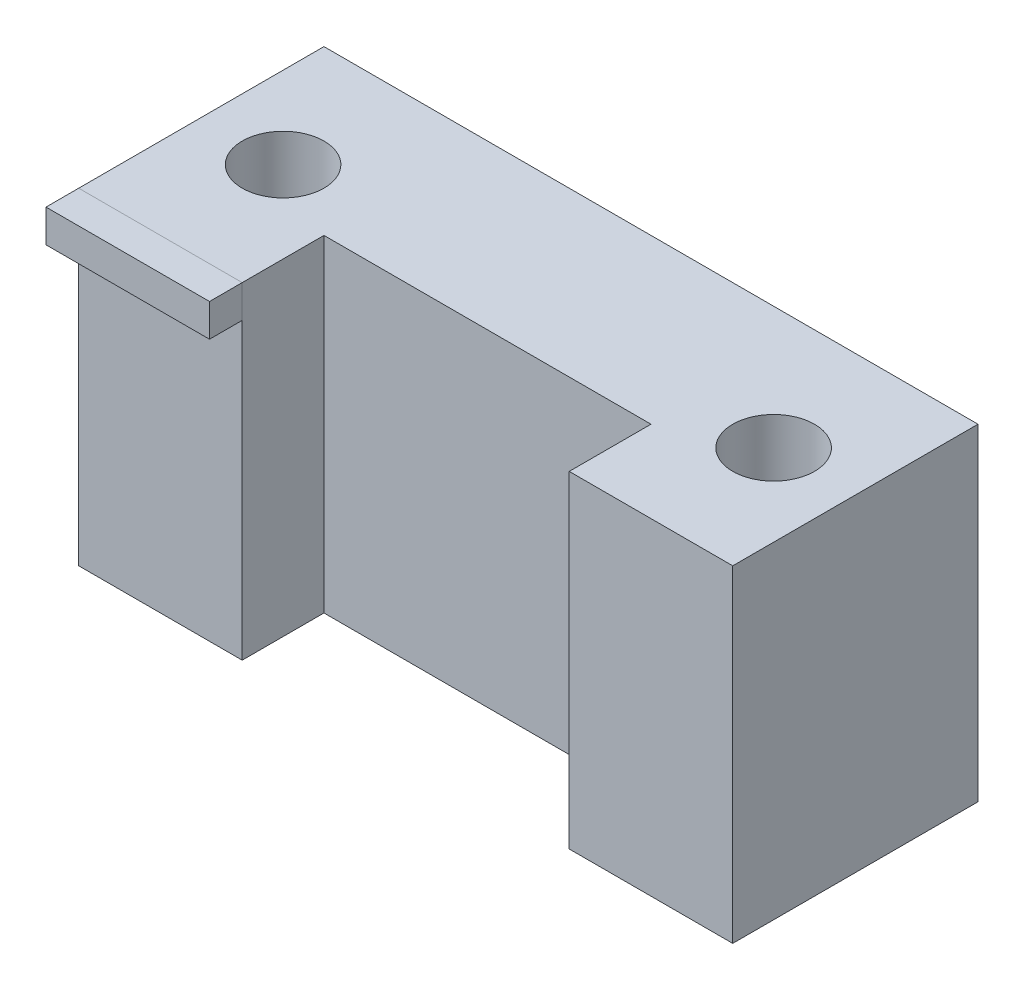
ISO-10303-21;
HEADER;
FILE_DESCRIPTION(('STEP AP214'),'2;1');
FILE_NAME('part.step','',(''),(''),'','','');
FILE_SCHEMA(('AUTOMOTIVE_DESIGN { 1 0 10303 214 1 1 1 1 }'));
ENDSEC;
DATA;
#1=APPLICATION_CONTEXT('core data for automotive mechanical design processes');
#2=APPLICATION_PROTOCOL_DEFINITION('international standard','automotive_design',2000,#1);
#3=PRODUCT_CONTEXT('',#1,'mechanical');
#4=PRODUCT('Part','Part','',(#3));
#5=PRODUCT_RELATED_PRODUCT_CATEGORY('part','',(#4));
#6=PRODUCT_DEFINITION_FORMATION('','',#4);
#7=PRODUCT_DEFINITION_CONTEXT('part definition',#1,'design');
#8=PRODUCT_DEFINITION('design','',#6,#7);
#9=PRODUCT_DEFINITION_SHAPE('','',#8);
#10=(LENGTH_UNIT() NAMED_UNIT(*) SI_UNIT(.MILLI.,.METRE.));
#11=(NAMED_UNIT(*) PLANE_ANGLE_UNIT() SI_UNIT($,.RADIAN.));
#12=(NAMED_UNIT(*) SI_UNIT($,.STERADIAN.) SOLID_ANGLE_UNIT());
#13=UNCERTAINTY_MEASURE_WITH_UNIT(LENGTH_MEASURE(1.E-05),#10,'distance_accuracy_value','');
#14=(GEOMETRIC_REPRESENTATION_CONTEXT(3) GLOBAL_UNCERTAINTY_ASSIGNED_CONTEXT((#13)) GLOBAL_UNIT_ASSIGNED_CONTEXT((#10,
#11,#12)) REPRESENTATION_CONTEXT('',''));
#15=CARTESIAN_POINT('',(0.,0.,0.));
#16=DIRECTION('',(0.,0.,1.));
#17=DIRECTION('',(1.,0.,0.));
#18=AXIS2_PLACEMENT_3D('',#15,#16,#17);
#19=CARTESIAN_POINT('',(0.,100.,10.));
#20=DIRECTION('',(1.,0.,0.));
#21=DIRECTION('',(0.,1.,0.));
#22=AXIS2_PLACEMENT_3D('',#19,#20,#21);
#23=PLANE('',#22);
#24=DIRECTION('',(0.,-1.,0.));
#25=VECTOR('',#24,1.);
#26=CARTESIAN_POINT('',(0.,100.,0.));
#27=LINE('',#26,#25);
#28=CARTESIAN_POINT('',(0.,100.,0.));
#29=VERTEX_POINT('',#28);
#30=CARTESIAN_POINT('',(0.,90.,0.));
#31=VERTEX_POINT('',#30);
#32=EDGE_CURVE('E105',#29,#31,#27,.T.);
#33=ORIENTED_EDGE('',*,*,#32,.T.);
#34=DIRECTION('',(0.,0.,-1.));
#35=VECTOR('',#34,1.);
#36=CARTESIAN_POINT('',(0.,90.,10.));
#37=LINE('',#36,#35);
#38=CARTESIAN_POINT('',(0.,90.,10.));
#39=VERTEX_POINT('',#38);
#40=EDGE_CURVE('E12',#39,#31,#37,.T.);
#41=ORIENTED_EDGE('',*,*,#40,.F.);
#42=DIRECTION('',(0.,-1.,0.));
#43=VECTOR('',#42,1.);
#44=CARTESIAN_POINT('',(0.,100.,10.));
#45=LINE('',#44,#43);
#46=CARTESIAN_POINT('',(0.,100.,10.));
#47=VERTEX_POINT('',#46);
#48=EDGE_CURVE('E93',#47,#39,#45,.T.);
#49=ORIENTED_EDGE('',*,*,#48,.F.);
#50=DIRECTION('',(0.,0.,-1.));
#51=VECTOR('',#50,1.);
#52=CARTESIAN_POINT('',(0.,100.,10.));
#53=LINE('',#52,#51);
#54=EDGE_CURVE('E101',#47,#29,#53,.T.);
#55=ORIENTED_EDGE('',*,*,#54,.T.);
#56=EDGE_LOOP('',(#33,#41,#49,#55));
#57=FACE_BOUND('',#56,.T.);
#58=ADVANCED_FACE('F42',(#57),#23,.F.);
#59=CARTESIAN_POINT('',(0.,90.,10.));
#60=DIRECTION('',(0.,1.,0.));
#61=DIRECTION('',(0.,0.,1.));
#62=AXIS2_PLACEMENT_3D('',#59,#60,#61);
#63=PLANE('',#62);
#64=DIRECTION('',(1.,0.,0.));
#65=VECTOR('',#64,1.);
#66=CARTESIAN_POINT('',(0.,90.,0.));
#67=LINE('',#66,#65);
#68=CARTESIAN_POINT('',(50.,90.,0.));
#69=VERTEX_POINT('',#68);
#70=EDGE_CURVE('E97',#31,#69,#67,.T.);
#71=ORIENTED_EDGE('',*,*,#70,.T.);
#72=DIRECTION('',(0.,0.,-1.));
#73=VECTOR('',#72,1.);
#74=CARTESIAN_POINT('',(50.,90.,10.));
#75=LINE('',#74,#73);
#76=CARTESIAN_POINT('',(50.,90.,10.));
#77=VERTEX_POINT('',#76);
#78=EDGE_CURVE('E50',#77,#69,#75,.T.);
#79=ORIENTED_EDGE('',*,*,#78,.F.);
#80=DIRECTION('',(1.,0.,0.));
#81=VECTOR('',#80,1.);
#82=CARTESIAN_POINT('',(0.,90.,10.));
#83=LINE('',#82,#81);
#84=EDGE_CURVE('E88',#39,#77,#83,.T.);
#85=ORIENTED_EDGE('',*,*,#84,.F.);
#86=ORIENTED_EDGE('',*,*,#40,.T.);
#87=EDGE_LOOP('',(#71,#79,#85,#86));
#88=FACE_BOUND('',#87,.T.);
#89=ADVANCED_FACE('F96',(#88),#63,.F.);
#90=CARTESIAN_POINT('',(50.,100.,10.));
#91=DIRECTION('',(-1.,0.,0.));
#92=DIRECTION('',(0.,0.,1.));
#93=AXIS2_PLACEMENT_3D('',#90,#91,#92);
#94=PLANE('',#93);
#95=DIRECTION('',(0.,1.,0.));
#96=VECTOR('',#95,1.);
#97=CARTESIAN_POINT('',(50.,100.,0.));
#98=LINE('',#97,#96);
#99=CARTESIAN_POINT('',(50.,100.,0.));
#100=VERTEX_POINT('',#99);
#101=EDGE_CURVE('E75',#69,#100,#98,.T.);
#102=ORIENTED_EDGE('',*,*,#101,.T.);
#103=DIRECTION('',(0.,0.,-1.));
#104=VECTOR('',#103,1.);
#105=CARTESIAN_POINT('',(50.,100.,10.));
#106=LINE('',#105,#104);
#107=CARTESIAN_POINT('',(50.,100.,10.));
#108=VERTEX_POINT('',#107);
#109=EDGE_CURVE('E98',#108,#100,#106,.T.);
#110=ORIENTED_EDGE('',*,*,#109,.F.);
#111=DIRECTION('',(0.,1.,0.));
#112=VECTOR('',#111,1.);
#113=CARTESIAN_POINT('',(50.,100.,10.));
#114=LINE('',#113,#112);
#115=EDGE_CURVE('E91',#77,#108,#114,.T.);
#116=ORIENTED_EDGE('',*,*,#115,.F.);
#117=ORIENTED_EDGE('',*,*,#78,.T.);
#118=EDGE_LOOP('',(#102,#110,#116,#117));
#119=FACE_BOUND('',#118,.T.);
#120=ADVANCED_FACE('F99',(#119),#94,.F.);
#121=CARTESIAN_POINT('',(0.,100.,10.));
#122=DIRECTION('',(0.,-1.,0.));
#123=DIRECTION('',(0.,0.,-1.));
#124=AXIS2_PLACEMENT_3D('',#121,#122,#123);
#125=PLANE('',#124);
#126=DIRECTION('',(-1.,0.,0.));
#127=VECTOR('',#126,1.);
#128=CARTESIAN_POINT('',(0.,100.,0.));
#129=LINE('',#128,#127);
#130=EDGE_CURVE('E81',#100,#29,#129,.T.);
#131=ORIENTED_EDGE('',*,*,#130,.T.);
#132=ORIENTED_EDGE('',*,*,#54,.F.);
#133=DIRECTION('',(-1.,0.,0.));
#134=VECTOR('',#133,1.);
#135=CARTESIAN_POINT('',(0.,100.,10.));
#136=LINE('',#135,#134);
#137=EDGE_CURVE('E58',#108,#47,#136,.T.);
#138=ORIENTED_EDGE('',*,*,#137,.F.);
#139=ORIENTED_EDGE('',*,*,#109,.T.);
#140=EDGE_LOOP('',(#131,#132,#138,#139));
#141=FACE_BOUND('',#140,.T.);
#142=ADVANCED_FACE('F112',(#141),#125,.F.);
#143=CARTESIAN_POINT('',(0.,0.,10.));
#144=DIRECTION('',(0.,0.,1.));
#145=DIRECTION('',(1.,0.,0.));
#146=AXIS2_PLACEMENT_3D('',#143,#144,#145);
#147=PLANE('',#146);
#148=ORIENTED_EDGE('',*,*,#48,.T.);
#149=ORIENTED_EDGE('',*,*,#84,.T.);
#150=ORIENTED_EDGE('',*,*,#115,.T.);
#151=ORIENTED_EDGE('',*,*,#137,.T.);
#152=EDGE_LOOP('',(#148,#149,#150,#151));
#153=FACE_BOUND('',#152,.T.);
#154=ADVANCED_FACE('F89',(#153),#147,.T.);
#155=CARTESIAN_POINT('',(0.,0.,0.));
#156=DIRECTION('',(0.,0.,1.));
#157=DIRECTION('',(1.,0.,0.));
#158=AXIS2_PLACEMENT_3D('',#155,#156,#157);
#159=PLANE('',#158);
#160=ORIENTED_EDGE('',*,*,#32,.F.);
#161=ORIENTED_EDGE('',*,*,#130,.F.);
#162=ORIENTED_EDGE('',*,*,#101,.F.);
#163=ORIENTED_EDGE('',*,*,#70,.F.);
#164=EDGE_LOOP('',(#160,#161,#162,#163));
#165=FACE_BOUND('',#164,.T.);
#166=ADVANCED_FACE('F115',(#165),#159,.F.);
#167=CLOSED_SHELL('',(#58,#89,#120,#142,#154,#166));
#168=MANIFOLD_SOLID_BREP('B2',#167);
#169=CARTESIAN_POINT('',(0.,100.,0.));
#170=DIRECTION('',(1.,0.,0.));
#171=DIRECTION('',(0.,0.,-1.));
#172=AXIS2_PLACEMENT_3D('',#169,#170,#171);
#173=PLANE('',#172);
#174=DIRECTION('',(0.,0.,1.));
#175=VECTOR('',#174,1.);
#176=CARTESIAN_POINT('',(0.,0.,0.));
#177=LINE('',#176,#175);
#178=CARTESIAN_POINT('',(0.,0.,-75.));
#179=VERTEX_POINT('',#178);
#180=CARTESIAN_POINT('',(0.,0.,0.));
#181=VERTEX_POINT('',#180);
#182=EDGE_CURVE('E261',#179,#181,#177,.T.);
#183=ORIENTED_EDGE('',*,*,#182,.T.);
#184=DIRECTION('',(0.,-1.,0.));
#185=VECTOR('',#184,1.);
#186=CARTESIAN_POINT('',(0.,100.,0.));
#187=LINE('',#186,#185);
#188=CARTESIAN_POINT('',(0.,100.,0.));
#189=VERTEX_POINT('',#188);
#190=EDGE_CURVE('E40',#189,#181,#187,.T.);
#191=ORIENTED_EDGE('',*,*,#190,.F.);
#192=DIRECTION('',(0.,0.,1.));
#193=VECTOR('',#192,1.);
#194=CARTESIAN_POINT('',(0.,100.,0.));
#195=LINE('',#194,#193);
#196=CARTESIAN_POINT('',(0.,100.,-75.));
#197=VERTEX_POINT('',#196);
#198=EDGE_CURVE('E276',#197,#189,#195,.T.);
#199=ORIENTED_EDGE('',*,*,#198,.F.);
#200=DIRECTION('',(0.,-1.,0.));
#201=VECTOR('',#200,1.);
#202=CARTESIAN_POINT('',(0.,100.,-75.));
#203=LINE('',#202,#201);
#204=EDGE_CURVE('E257',#197,#179,#203,.T.);
#205=ORIENTED_EDGE('',*,*,#204,.T.);
#206=EDGE_LOOP('',(#183,#191,#199,#205));
#207=FACE_BOUND('',#206,.T.);
#208=ADVANCED_FACE('F165',(#207),#173,.F.);
#209=CARTESIAN_POINT('',(0.,100.,0.));
#210=DIRECTION('',(0.,0.,-1.));
#211=DIRECTION('',(-1.,0.,0.));
#212=AXIS2_PLACEMENT_3D('',#209,#210,#211);
#213=PLANE('',#212);
#214=DIRECTION('',(1.,0.,0.));
#215=VECTOR('',#214,1.);
#216=CARTESIAN_POINT('',(0.,0.,0.));
#217=LINE('',#216,#215);
#218=CARTESIAN_POINT('',(50.,0.,0.));
#219=VERTEX_POINT('',#218);
#220=EDGE_CURVE('E264',#181,#219,#217,.T.);
#221=ORIENTED_EDGE('',*,*,#220,.T.);
#222=DIRECTION('',(0.,-1.,0.));
#223=VECTOR('',#222,1.);
#224=CARTESIAN_POINT('',(50.,100.,0.));
#225=LINE('',#224,#223);
#226=CARTESIAN_POINT('',(50.,100.,0.));
#227=VERTEX_POINT('',#226);
#228=EDGE_CURVE('E173',#227,#219,#225,.T.);
#229=ORIENTED_EDGE('',*,*,#228,.F.);
#230=DIRECTION('',(1.,0.,0.));
#231=VECTOR('',#230,1.);
#232=CARTESIAN_POINT('',(0.,100.,0.));
#233=LINE('',#232,#231);
#234=EDGE_CURVE('E224',#189,#227,#233,.T.);
#235=ORIENTED_EDGE('',*,*,#234,.F.);
#236=ORIENTED_EDGE('',*,*,#190,.T.);
#237=EDGE_LOOP('',(#221,#229,#235,#236));
#238=FACE_BOUND('',#237,.T.);
#239=ADVANCED_FACE('F340',(#238),#213,.F.);
#240=CARTESIAN_POINT('',(50.,100.,0.));
#241=DIRECTION('',(-1.,0.,0.));
#242=DIRECTION('',(0.,0.,1.));
#243=AXIS2_PLACEMENT_3D('',#240,#241,#242);
#244=PLANE('',#243);
#245=DIRECTION('',(0.,0.,-1.));
#246=VECTOR('',#245,1.);
#247=CARTESIAN_POINT('',(50.,0.,0.));
#248=LINE('',#247,#246);
#249=CARTESIAN_POINT('',(50.,0.,-25.));
#250=VERTEX_POINT('',#249);
#251=EDGE_CURVE('E267',#219,#250,#248,.T.);
#252=ORIENTED_EDGE('',*,*,#251,.T.);
#253=DIRECTION('',(0.,-1.,0.));
#254=VECTOR('',#253,1.);
#255=CARTESIAN_POINT('',(50.,100.,-25.));
#256=LINE('',#255,#254);
#257=CARTESIAN_POINT('',(50.,100.,-25.));
#258=VERTEX_POINT('',#257);
#259=EDGE_CURVE('E283',#258,#250,#256,.T.);
#260=ORIENTED_EDGE('',*,*,#259,.F.);
#261=DIRECTION('',(0.,0.,-1.));
#262=VECTOR('',#261,1.);
#263=CARTESIAN_POINT('',(50.,100.,0.));
#264=LINE('',#263,#262);
#265=EDGE_CURVE('E291',#227,#258,#264,.T.);
#266=ORIENTED_EDGE('',*,*,#265,.F.);
#267=ORIENTED_EDGE('',*,*,#228,.T.);
#268=EDGE_LOOP('',(#252,#260,#266,#267));
#269=FACE_BOUND('',#268,.T.);
#270=ADVANCED_FACE('F289',(#269),#244,.F.);
#271=CARTESIAN_POINT('',(50.,100.,-25.));
#272=DIRECTION('',(0.,0.,-1.));
#273=DIRECTION('',(-1.,0.,0.));
#274=AXIS2_PLACEMENT_3D('',#271,#272,#273);
#275=PLANE('',#274);
#276=DIRECTION('',(1.,0.,0.));
#277=VECTOR('',#276,1.);
#278=CARTESIAN_POINT('',(50.,0.,-25.));
#279=LINE('',#278,#277);
#280=CARTESIAN_POINT('',(150.,0.,-25.));
#281=VERTEX_POINT('',#280);
#282=EDGE_CURVE('E269',#250,#281,#279,.T.);
#283=ORIENTED_EDGE('',*,*,#282,.T.);
#284=DIRECTION('',(0.,-1.,0.));
#285=VECTOR('',#284,1.);
#286=CARTESIAN_POINT('',(150.,100.,-25.));
#287=LINE('',#286,#285);
#288=CARTESIAN_POINT('',(150.,100.,-25.));
#289=VERTEX_POINT('',#288);
#290=EDGE_CURVE('E280',#289,#281,#287,.T.);
#291=ORIENTED_EDGE('',*,*,#290,.F.);
#292=DIRECTION('',(1.,0.,0.));
#293=VECTOR('',#292,1.);
#294=CARTESIAN_POINT('',(50.,100.,-25.));
#295=LINE('',#294,#293);
#296=EDGE_CURVE('E303',#258,#289,#295,.T.);
#297=ORIENTED_EDGE('',*,*,#296,.F.);
#298=ORIENTED_EDGE('',*,*,#259,.T.);
#299=EDGE_LOOP('',(#283,#291,#297,#298));
#300=FACE_BOUND('',#299,.T.);
#301=ADVANCED_FACE('F299',(#300),#275,.F.);
#302=CARTESIAN_POINT('',(150.,100.,0.));
#303=DIRECTION('',(1.,0.,0.));
#304=DIRECTION('',(0.,0.,-1.));
#305=AXIS2_PLACEMENT_3D('',#302,#303,#304);
#306=PLANE('',#305);
#307=DIRECTION('',(0.,0.,1.));
#308=VECTOR('',#307,1.);
#309=CARTESIAN_POINT('',(150.,0.,0.));
#310=LINE('',#309,#308);
#311=CARTESIAN_POINT('',(150.,0.,0.));
#312=VERTEX_POINT('',#311);
#313=EDGE_CURVE('E271',#281,#312,#310,.T.);
#314=ORIENTED_EDGE('',*,*,#313,.T.);
#315=DIRECTION('',(0.,-1.,0.));
#316=VECTOR('',#315,1.);
#317=CARTESIAN_POINT('',(150.,100.,0.));
#318=LINE('',#317,#316);
#319=CARTESIAN_POINT('',(150.,100.,0.));
#320=VERTEX_POINT('',#319);
#321=EDGE_CURVE('E252',#320,#312,#318,.T.);
#322=ORIENTED_EDGE('',*,*,#321,.F.);
#323=DIRECTION('',(0.,0.,1.));
#324=VECTOR('',#323,1.);
#325=CARTESIAN_POINT('',(150.,100.,0.));
#326=LINE('',#325,#324);
#327=EDGE_CURVE('E243',#289,#320,#326,.T.);
#328=ORIENTED_EDGE('',*,*,#327,.F.);
#329=ORIENTED_EDGE('',*,*,#290,.T.);
#330=EDGE_LOOP('',(#314,#322,#328,#329));
#331=FACE_BOUND('',#330,.T.);
#332=ADVANCED_FACE('F302',(#331),#306,.F.);
#333=CARTESIAN_POINT('',(150.,100.,0.));
#334=DIRECTION('',(0.,0.,-1.));
#335=DIRECTION('',(-1.,0.,0.));
#336=AXIS2_PLACEMENT_3D('',#333,#334,#335);
#337=PLANE('',#336);
#338=DIRECTION('',(1.,0.,0.));
#339=VECTOR('',#338,1.);
#340=CARTESIAN_POINT('',(150.,0.,0.));
#341=LINE('',#340,#339);
#342=CARTESIAN_POINT('',(200.,0.,0.));
#343=VERTEX_POINT('',#342);
#344=EDGE_CURVE('E251',#312,#343,#341,.T.);
#345=ORIENTED_EDGE('',*,*,#344,.T.);
#346=DIRECTION('',(0.,-1.,0.));
#347=VECTOR('',#346,1.);
#348=CARTESIAN_POINT('',(200.,100.,0.));
#349=LINE('',#348,#347);
#350=CARTESIAN_POINT('',(200.,100.,0.));
#351=VERTEX_POINT('',#350);
#352=EDGE_CURVE('E248',#351,#343,#349,.T.);
#353=ORIENTED_EDGE('',*,*,#352,.F.);
#354=DIRECTION('',(1.,0.,0.));
#355=VECTOR('',#354,1.);
#356=CARTESIAN_POINT('',(150.,100.,0.));
#357=LINE('',#356,#355);
#358=EDGE_CURVE('E237',#320,#351,#357,.T.);
#359=ORIENTED_EDGE('',*,*,#358,.F.);
#360=ORIENTED_EDGE('',*,*,#321,.T.);
#361=EDGE_LOOP('',(#345,#353,#359,#360));
#362=FACE_BOUND('',#361,.T.);
#363=ADVANCED_FACE('F249',(#362),#337,.F.);
#364=CARTESIAN_POINT('',(200.,100.,0.));
#365=DIRECTION('',(-1.,0.,0.));
#366=DIRECTION('',(0.,0.,1.));
#367=AXIS2_PLACEMENT_3D('',#364,#365,#366);
#368=PLANE('',#367);
#369=DIRECTION('',(0.,0.,-1.));
#370=VECTOR('',#369,1.);
#371=CARTESIAN_POINT('',(200.,0.,0.));
#372=LINE('',#371,#370);
#373=CARTESIAN_POINT('',(200.,0.,-75.));
#374=VERTEX_POINT('',#373);
#375=EDGE_CURVE('E210',#343,#374,#372,.T.);
#376=ORIENTED_EDGE('',*,*,#375,.T.);
#377=DIRECTION('',(0.,-1.,0.));
#378=VECTOR('',#377,1.);
#379=CARTESIAN_POINT('',(200.,100.,-75.));
#380=LINE('',#379,#378);
#381=CARTESIAN_POINT('',(200.,100.,-75.));
#382=VERTEX_POINT('',#381);
#383=EDGE_CURVE('E253',#382,#374,#380,.T.);
#384=ORIENTED_EDGE('',*,*,#383,.F.);
#385=DIRECTION('',(0.,0.,-1.));
#386=VECTOR('',#385,1.);
#387=CARTESIAN_POINT('',(200.,100.,0.));
#388=LINE('',#387,#386);
#389=EDGE_CURVE('E241',#351,#382,#388,.T.);
#390=ORIENTED_EDGE('',*,*,#389,.F.);
#391=ORIENTED_EDGE('',*,*,#352,.T.);
#392=EDGE_LOOP('',(#376,#384,#390,#391));
#393=FACE_BOUND('',#392,.T.);
#394=ADVANCED_FACE('F255',(#393),#368,.F.);
#395=CARTESIAN_POINT('',(0.,100.,-75.));
#396=DIRECTION('',(0.,0.,1.));
#397=DIRECTION('',(1.,0.,0.));
#398=AXIS2_PLACEMENT_3D('',#395,#396,#397);
#399=PLANE('',#398);
#400=DIRECTION('',(-1.,0.,0.));
#401=VECTOR('',#400,1.);
#402=CARTESIAN_POINT('',(0.,0.,-75.));
#403=LINE('',#402,#401);
#404=EDGE_CURVE('E216',#374,#179,#403,.T.);
#405=ORIENTED_EDGE('',*,*,#404,.T.);
#406=ORIENTED_EDGE('',*,*,#204,.F.);
#407=DIRECTION('',(-1.,0.,0.));
#408=VECTOR('',#407,1.);
#409=CARTESIAN_POINT('',(0.,100.,-75.));
#410=LINE('',#409,#408);
#411=EDGE_CURVE('E181',#382,#197,#410,.T.);
#412=ORIENTED_EDGE('',*,*,#411,.F.);
#413=ORIENTED_EDGE('',*,*,#383,.T.);
#414=EDGE_LOOP('',(#405,#406,#412,#413));
#415=FACE_BOUND('',#414,.T.);
#416=ADVANCED_FACE('F347',(#415),#399,.F.);
#417=CARTESIAN_POINT('',(0.,100.,0.));
#418=DIRECTION('',(0.,-1.,0.));
#419=DIRECTION('',(0.,0.,-1.));
#420=AXIS2_PLACEMENT_3D('',#417,#418,#419);
#421=PLANE('',#420);
#422=CARTESIAN_POINT('',(175.,100.,-37.5));
#423=DIRECTION('',(0.,-1.,0.));
#424=DIRECTION('',(0.,0.,-1.));
#425=AXIS2_PLACEMENT_3D('',#422,#423,#424);
#426=CIRCLE('',#425,12.5);
#427=CARTESIAN_POINT('',(175.,100.,-50.));
#428=VERTEX_POINT('',#427);
#429=EDGE_CURVE('E314',#428,#428,#426,.T.);
#430=ORIENTED_EDGE('',*,*,#429,.T.);
#431=EDGE_LOOP('',(#430));
#432=FACE_BOUND('',#431,.T.);
#433=CARTESIAN_POINT('',(25.,100.,-37.5));
#434=DIRECTION('',(0.,-1.,0.));
#435=DIRECTION('',(0.,0.,-1.));
#436=AXIS2_PLACEMENT_3D('',#433,#434,#435);
#437=CIRCLE('',#436,12.5);
#438=CARTESIAN_POINT('',(25.,100.,-50.));
#439=VERTEX_POINT('',#438);
#440=EDGE_CURVE('E265',#439,#439,#437,.T.);
#441=ORIENTED_EDGE('',*,*,#440,.T.);
#442=EDGE_LOOP('',(#441));
#443=FACE_BOUND('',#442,.T.);
#444=ORIENTED_EDGE('',*,*,#198,.T.);
#445=ORIENTED_EDGE('',*,*,#234,.T.);
#446=ORIENTED_EDGE('',*,*,#265,.T.);
#447=ORIENTED_EDGE('',*,*,#296,.T.);
#448=ORIENTED_EDGE('',*,*,#327,.T.);
#449=ORIENTED_EDGE('',*,*,#358,.T.);
#450=ORIENTED_EDGE('',*,*,#389,.T.);
#451=ORIENTED_EDGE('',*,*,#411,.T.);
#452=EDGE_LOOP('',(#444,#445,#446,#447,#448,#449,#450,#451));
#453=FACE_BOUND('',#452,.T.);
#454=ADVANCED_FACE('F239',(#432,#443,#453),#421,.F.);
#455=CARTESIAN_POINT('',(0.,0.,0.));
#456=DIRECTION('',(0.,-1.,0.));
#457=DIRECTION('',(0.,0.,-1.));
#458=AXIS2_PLACEMENT_3D('',#455,#456,#457);
#459=PLANE('',#458);
#460=CARTESIAN_POINT('',(175.,0.,-37.5));
#461=DIRECTION('',(0.,-1.,0.));
#462=DIRECTION('',(0.,0.,-1.));
#463=AXIS2_PLACEMENT_3D('',#460,#461,#462);
#464=CIRCLE('',#463,12.5);
#465=CARTESIAN_POINT('',(175.,0.,-50.));
#466=VERTEX_POINT('',#465);
#467=EDGE_CURVE('E317',#466,#466,#464,.T.);
#468=ORIENTED_EDGE('',*,*,#467,.F.);
#469=EDGE_LOOP('',(#468));
#470=FACE_BOUND('',#469,.T.);
#471=CARTESIAN_POINT('',(25.,0.,-37.5));
#472=DIRECTION('',(0.,-1.,0.));
#473=DIRECTION('',(0.,0.,-1.));
#474=AXIS2_PLACEMENT_3D('',#471,#472,#473);
#475=CIRCLE('',#474,12.5);
#476=CARTESIAN_POINT('',(25.,0.,-50.));
#477=VERTEX_POINT('',#476);
#478=EDGE_CURVE('E311',#477,#477,#475,.T.);
#479=ORIENTED_EDGE('',*,*,#478,.F.);
#480=EDGE_LOOP('',(#479));
#481=FACE_BOUND('',#480,.T.);
#482=ORIENTED_EDGE('',*,*,#182,.F.);
#483=ORIENTED_EDGE('',*,*,#404,.F.);
#484=ORIENTED_EDGE('',*,*,#375,.F.);
#485=ORIENTED_EDGE('',*,*,#344,.F.);
#486=ORIENTED_EDGE('',*,*,#313,.F.);
#487=ORIENTED_EDGE('',*,*,#282,.F.);
#488=ORIENTED_EDGE('',*,*,#251,.F.);
#489=ORIENTED_EDGE('',*,*,#220,.F.);
#490=EDGE_LOOP('',(#482,#483,#484,#485,#486,#487,#488,#489));
#491=FACE_BOUND('',#490,.T.);
#492=ADVANCED_FACE('F295',(#470,#481,#491),#459,.T.);
#493=CARTESIAN_POINT('',(25.,0.,-37.5));
#494=DIRECTION('',(0.,-1.,0.));
#495=DIRECTION('',(0.,0.,-1.));
#496=AXIS2_PLACEMENT_3D('',#493,#494,#495);
#497=CYLINDRICAL_SURFACE('',#496,12.5);
#498=ORIENTED_EDGE('',*,*,#440,.F.);
#499=EDGE_LOOP('',(#498));
#500=FACE_BOUND('',#499,.T.);
#501=ORIENTED_EDGE('',*,*,#478,.T.);
#502=EDGE_LOOP('',(#501));
#503=FACE_BOUND('',#502,.T.);
#504=ADVANCED_FACE('F325',(#500,#503),#497,.F.);
#505=CARTESIAN_POINT('',(175.,0.,-37.5));
#506=DIRECTION('',(0.,-1.,0.));
#507=DIRECTION('',(0.,0.,-1.));
#508=AXIS2_PLACEMENT_3D('',#505,#506,#507);
#509=CYLINDRICAL_SURFACE('',#508,12.5);
#510=ORIENTED_EDGE('',*,*,#429,.F.);
#511=EDGE_LOOP('',(#510));
#512=FACE_BOUND('',#511,.T.);
#513=ORIENTED_EDGE('',*,*,#467,.T.);
#514=EDGE_LOOP('',(#513));
#515=FACE_BOUND('',#514,.T.);
#516=ADVANCED_FACE('F321',(#512,#515),#509,.F.);
#517=CLOSED_SHELL('',(#208,#239,#270,#301,#332,#363,#394,#416,#454,#492,#504,#516));
#518=MANIFOLD_SOLID_BREP('B6',#517);
#519=ADVANCED_BREP_SHAPE_REPRESENTATION('',(#18,#168,#518),#14);
#520=SHAPE_DEFINITION_REPRESENTATION(#9,#519);
ENDSEC;
END-ISO-10303-21;
